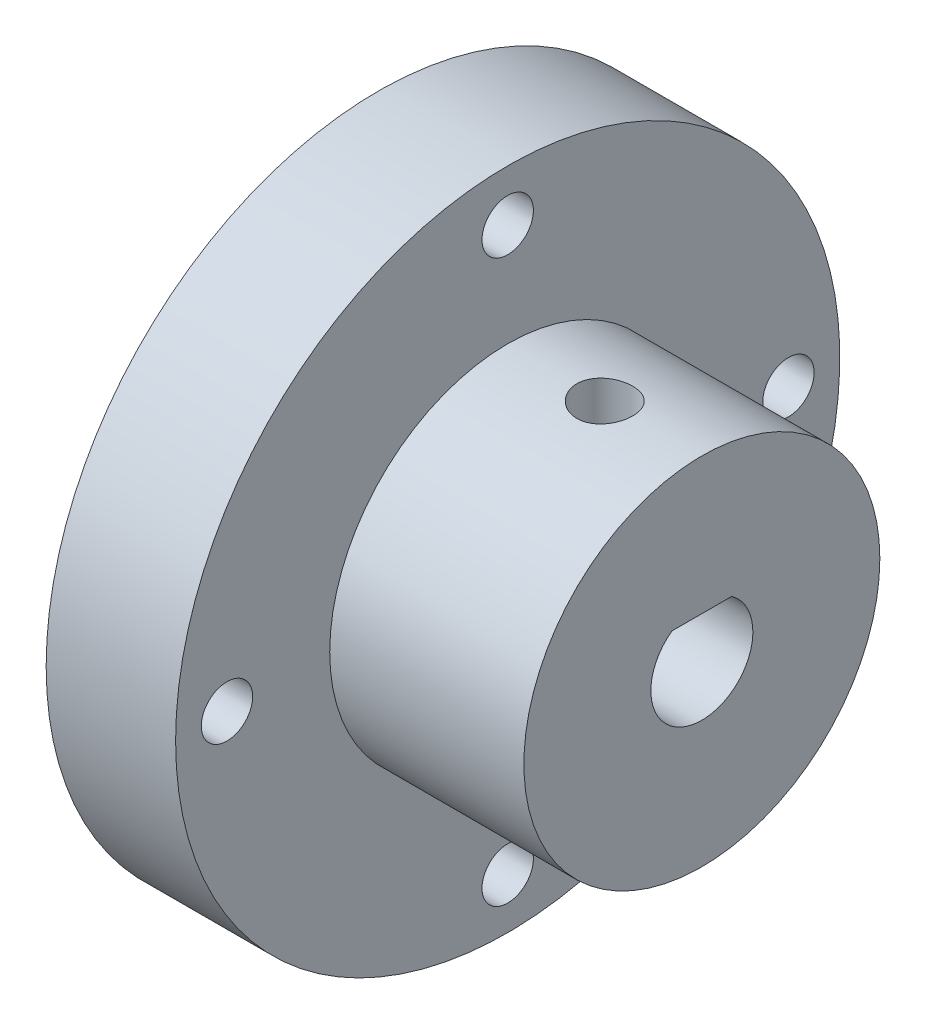
ISO-10303-21;
HEADER;
FILE_DESCRIPTION(('STEP AP214'),'2;1');
FILE_NAME('part.step','',(''),(''),'','','');
FILE_SCHEMA(('AUTOMOTIVE_DESIGN { 1 0 10303 214 1 1 1 1 }'));
ENDSEC;
DATA;
#1=APPLICATION_CONTEXT('core data for automotive mechanical design processes');
#2=APPLICATION_PROTOCOL_DEFINITION('international standard','automotive_design',2000,#1);
#3=PRODUCT_CONTEXT('',#1,'mechanical');
#4=PRODUCT('Part','Part','',(#3));
#5=PRODUCT_RELATED_PRODUCT_CATEGORY('part','',(#4));
#6=PRODUCT_DEFINITION_FORMATION('','',#4);
#7=PRODUCT_DEFINITION_CONTEXT('part definition',#1,'design');
#8=PRODUCT_DEFINITION('design','',#6,#7);
#9=PRODUCT_DEFINITION_SHAPE('','',#8);
#10=(LENGTH_UNIT() NAMED_UNIT(*) SI_UNIT(.MILLI.,.METRE.));
#11=(NAMED_UNIT(*) PLANE_ANGLE_UNIT() SI_UNIT($,.RADIAN.));
#12=(NAMED_UNIT(*) SI_UNIT($,.STERADIAN.) SOLID_ANGLE_UNIT());
#13=UNCERTAINTY_MEASURE_WITH_UNIT(LENGTH_MEASURE(1.E-05),#10,'distance_accuracy_value','');
#14=(GEOMETRIC_REPRESENTATION_CONTEXT(3) GLOBAL_UNCERTAINTY_ASSIGNED_CONTEXT((#13)) GLOBAL_UNIT_ASSIGNED_CONTEXT((#10,
#11,#12)) REPRESENTATION_CONTEXT('',''));
#15=CARTESIAN_POINT('',(0.,0.,0.));
#16=DIRECTION('',(0.,0.,1.));
#17=DIRECTION('',(1.,0.,0.));
#18=AXIS2_PLACEMENT_3D('',#15,#16,#17);
#19=CARTESIAN_POINT('',(127.837955952687,-6.875,0.));
#20=DIRECTION('',(1.,0.,0.));
#21=DIRECTION('',(0.,0.,-1.));
#22=AXIS2_PLACEMENT_3D('',#19,#20,#21);
#23=CYLINDRICAL_SURFACE('',#22,10.9999999999998);
#24=CARTESIAN_POINT('',(133.837955952687,3.98855283321235,-1.72719999999998));
#25=CARTESIAN_POINT('',(133.741582164186,3.98855450094201,-1.72719606137562));
#26=CARTESIAN_POINT('',(133.645153784297,3.98984915929709,-1.71910655338466));
#27=CARTESIAN_POINT('',(133.454996967914,3.99488390785363,-1.68697308164134));
#28=CARTESIAN_POINT('',(133.361271195248,3.99862633009087,-1.66291390292531));
#29=CARTESIAN_POINT('',(133.179299390597,4.00812252060285,-1.59958199104845));
#30=CARTESIAN_POINT('',(133.091049065102,4.01387468887242,-1.56032135743422));
#31=CARTESIAN_POINT('',(132.922399846018,4.02674035181642,-1.46773018643057));
#32=CARTESIAN_POINT('',(132.841999954225,4.03385367307518,-1.41440144104074));
#33=CARTESIAN_POINT('',(132.690618155758,4.04870981442783,-1.29468911194899));
#34=CARTESIAN_POINT('',(132.619715008976,4.05645713164937,-1.22820647786876));
#35=CARTESIAN_POINT('',(132.490022545965,4.07166827802654,-1.08428753579914));
#36=CARTESIAN_POINT('',(132.431233916657,4.07913209108724,-1.00685060709467));
#37=CARTESIAN_POINT('',(132.327146583678,4.09298254154328,-0.842714236482703));
#38=CARTESIAN_POINT('',(132.28192073209,4.09936328449077,-0.755968055496532));
#39=CARTESIAN_POINT('',(132.206710571123,4.11027874992955,-0.575993551775798));
#40=CARTESIAN_POINT('',(132.176725380783,4.11481357911768,-0.482765604062736));
#41=CARTESIAN_POINT('',(132.133087362895,4.12149452938,-0.293286221978619));
#42=CARTESIAN_POINT('',(132.119302452618,4.12365995829595,-0.197065898736473));
#43=CARTESIAN_POINT('',(132.10804592829,4.12542436406966,-0.00365524576250754));
#44=CARTESIAN_POINT('',(132.110573324763,4.12502349659446,0.0935350247769484));
#45=CARTESIAN_POINT('',(132.131765938019,4.12171584501062,0.285224758765083));
#46=CARTESIAN_POINT('',(132.150289035801,4.11883113010667,0.379740369474631));
#47=CARTESIAN_POINT('',(132.202723879313,4.11090449935043,0.564305000498965));
#48=CARTESIAN_POINT('',(132.236636051459,4.1058625237228,0.654353896968815));
#49=CARTESIAN_POINT('',(132.319030150916,4.09415009410192,0.82785603167086));
#50=CARTESIAN_POINT('',(132.367571388062,4.08747303212242,0.911280640125496));
#51=CARTESIAN_POINT('',(132.477802347883,4.073233642306,1.06885395923958));
#52=CARTESIAN_POINT('',(132.539493017491,4.06567125073127,1.14300200125228));
#53=CARTESIAN_POINT('',(132.675061979254,4.05040745995442,1.28075594547385));
#54=CARTESIAN_POINT('',(132.749064409706,4.04270544089717,1.34423967098144));
#55=CARTESIAN_POINT('',(132.906735907637,4.02810965559152,1.45790745790038));
#56=CARTESIAN_POINT('',(132.99040504597,4.0212158952682,1.50809142181903));
#57=CARTESIAN_POINT('',(133.165168101527,4.0090171290002,1.59375471030395));
#58=CARTESIAN_POINT('',(133.256268712566,4.00371357597366,1.62922059875841));
#59=CARTESIAN_POINT('',(133.443235660047,3.99532070896741,1.68431341951108));
#60=CARTESIAN_POINT('',(133.539101626046,3.99223122316043,1.70394158094378));
#61=CARTESIAN_POINT('',(133.731788471707,3.98864915975394,1.72663238804305));
#62=CARTESIAN_POINT('',(133.828588420645,3.98812937060408,1.72986862344594));
#63=CARTESIAN_POINT('',(134.021347697544,3.98967321248436,1.72014513498913));
#64=CARTESIAN_POINT('',(134.11730705407,3.99173675538071,1.7071859636572));
#65=CARTESIAN_POINT('',(134.305117863983,3.99818969636732,1.66558707261261));
#66=CARTESIAN_POINT('',(134.396989126361,4.00256614869939,1.63703460192346));
#67=CARTESIAN_POINT('',(134.574642197797,4.01314104088936,1.56515067502826));
#68=CARTESIAN_POINT('',(134.66042367956,4.01933957858313,1.52181842521005));
#69=CARTESIAN_POINT('',(134.824238043437,4.03292397215392,1.42119093233954));
#70=CARTESIAN_POINT('',(134.902201393865,4.04031917394761,1.36378378049858));
#71=CARTESIAN_POINT('',(135.047449962061,4.05543583091654,1.23679082353464));
#72=CARTESIAN_POINT('',(135.114734515666,4.06315730634645,1.16720426148356));
#73=CARTESIAN_POINT('',(135.237343221498,4.07814196317737,1.01706141926204));
#74=CARTESIAN_POINT('',(135.292552034649,4.08540029253581,0.93641039506751));
#75=CARTESIAN_POINT('',(135.38863674779,4.09856445967651,0.766877675764675));
#76=CARTESIAN_POINT('',(135.429513069914,4.10447033729074,0.677996223164621));
#77=CARTESIAN_POINT('',(135.495590140536,4.11424297989528,0.49487861219056));
#78=CARTESIAN_POINT('',(135.52085284234,4.1181177945176,0.400665257215822));
#79=CARTESIAN_POINT('',(135.555185661229,4.12342561482485,0.209267916562917));
#80=CARTESIAN_POINT('',(135.56425695483,4.12485879792585,0.112084147246147));
#81=CARTESIAN_POINT('',(135.565918637882,4.12511979840211,-0.0813789102979204));
#82=CARTESIAN_POINT('',(135.558685097288,4.12397544970124,-0.177656694641055));
#83=CARTESIAN_POINT('',(135.52832124641,4.11926637381135,-0.367608463648281));
#84=CARTESIAN_POINT('',(135.505191001808,4.11570165662278,-0.46128245906903));
#85=CARTESIAN_POINT('',(135.443754906796,4.10655066793821,-0.643311484025552));
#86=CARTESIAN_POINT('',(135.405462391196,4.10096617315477,-0.731671108961141));
#87=CARTESIAN_POINT('',(135.314807832767,4.08838746855429,-0.900738701147149));
#88=CARTESIAN_POINT('',(135.262445246066,4.08139320424589,-0.98144637245175));
#89=CARTESIAN_POINT('',(135.14450531857,4.0666818854301,-1.13380967891502));
#90=CARTESIAN_POINT('',(135.078798396616,4.05895817475858,-1.20536437638943));
#91=CARTESIAN_POINT('',(134.93630750883,4.04370640454991,-1.33649533455943));
#92=CARTESIAN_POINT('',(134.859520950261,4.03617839129575,-1.3960687836998));
#93=CARTESIAN_POINT('',(134.696487949566,4.0221201479543,-1.50188136131825));
#94=CARTESIAN_POINT('',(134.610185789391,4.01559639586525,-1.54803549649206));
#95=CARTESIAN_POINT('',(134.430989969626,4.00436148299585,-1.625122867049));
#96=CARTESIAN_POINT('',(134.338103158176,3.99964847084876,-1.65607165800908));
#97=CARTESIAN_POINT('',(134.177010371088,3.99363979101371,-1.69496905240089));
#98=CARTESIAN_POINT('',(134.109791675244,3.99174249561103,-1.7070368010495));
#99=CARTESIAN_POINT('',(133.974376413297,3.9891984357644,-1.72315360895853));
#100=CARTESIAN_POINT('',(133.906179861839,3.98855165261087,-1.72720278818913));
#101=CARTESIAN_POINT('',(133.837955952687,3.98855283321235,-1.72719999999998));
#102=B_SPLINE_CURVE_WITH_KNOTS('',3,(#24,#25,#26,#27,#28,#29,#30,#31,#32,#33,#34,#35,#36,#37,
#38,#39,#40,#41,#42,#43,#44,#45,#46,#47,#48,#49,#50,#51,#52,#53,#54,#55,#56,#57,#58,#59,#60,#61,
#62,#63,#64,#65,#66,#67,#68,#69,#70,#71,#72,#73,#74,#75,#76,#77,#78,#79,#80,#81,#82,#83,#84,#85,
#86,#87,#88,#89,#90,#91,#92,#93,#94,#95,#96,#97,#98,#99,#100,#101),.UNSPECIFIED.,.T.,.F.,(4,2,2,
2,2,2,2,2,2,2,2,2,2,2,2,2,2,2,2,2,2,2,2,2,2,2,2,2,2,2,2,2,2,2,2,2,2,2,4),(0.,0.288871952824753,
0.578019521666526,0.866937416023922,1.15581852570345,1.44696395093358,1.738125880266,
2.03082486278384,2.32350692441951,2.61378578629694,2.90404704053421,3.19175560181875,
3.47947213570967,3.76837120444907,4.0572910847966,4.34932351783204,4.64135809152576,
4.93365867983339,5.22593658109138,5.51511270438839,5.8042789623277,6.09184358552619,
6.37942365217026,6.66936894816278,6.95933227012815,7.2519546504729,7.54456841148794,
7.83601352793892,8.12743746623261,8.41572951807279,8.70402037875657,8.99205825655828,
9.28010726992959,9.57110003891341,9.86216101365112,10.1550271974969,10.4475931422862,
10.6520913677953,10.8565865336719),.UNSPECIFIED.);
#103=CARTESIAN_POINT('',(133.837955952687,3.98855283321235,-1.72719999999998));
#104=VERTEX_POINT('',#103);
#105=EDGE_CURVE('E40',#104,#104,#102,.T.);
#106=ORIENTED_EDGE('',*,*,#105,.F.);
#107=EDGE_LOOP('',(#106));
#108=FACE_BOUND('',#107,.T.);
#109=CARTESIAN_POINT('',(127.837955952687,-6.875,0.));
#110=DIRECTION('',(-1.,0.,0.));
#111=DIRECTION('',(0.,0.,1.));
#112=AXIS2_PLACEMENT_3D('',#109,#110,#111);
#113=CIRCLE('',#112,10.9999999999998);
#114=CARTESIAN_POINT('',(127.837955952687,-6.875,10.9999999999998));
#115=VERTEX_POINT('',#114);
#116=EDGE_CURVE('E50',#115,#115,#113,.F.);
#117=ORIENTED_EDGE('',*,*,#116,.T.);
#118=EDGE_LOOP('',(#117));
#119=FACE_BOUND('',#118,.T.);
#120=CARTESIAN_POINT('',(139.837955952687,-6.875,0.));
#121=DIRECTION('',(1.,0.,0.));
#122=DIRECTION('',(0.,0.,-1.));
#123=AXIS2_PLACEMENT_3D('',#120,#121,#122);
#124=CIRCLE('',#123,10.9999999999998);
#125=CARTESIAN_POINT('',(139.837955952687,-6.875,-10.9999999999998));
#126=VERTEX_POINT('',#125);
#127=EDGE_CURVE('E12',#126,#126,#124,.T.);
#128=ORIENTED_EDGE('',*,*,#127,.F.);
#129=EDGE_LOOP('',(#128));
#130=FACE_BOUND('',#129,.T.);
#131=ADVANCED_FACE('F36',(#108,#119,#130),#23,.T.);
#132=CARTESIAN_POINT('',(139.837955952687,-6.875,0.));
#133=DIRECTION('',(1.,0.,0.));
#134=DIRECTION('',(0.,0.,-1.));
#135=AXIS2_PLACEMENT_3D('',#132,#133,#134);
#136=PLANE('',#135);
#137=DIRECTION('',(0.,0.,1.));
#138=VECTOR('',#137,1.);
#139=CARTESIAN_POINT('',(139.837955952687,-4.32260000000017,0.));
#140=LINE('',#139,#138);
#141=CARTESIAN_POINT('',(139.837955952687,-4.32260000000017,-1.8501026998526));
#142=VERTEX_POINT('',#141);
#143=CARTESIAN_POINT('',(139.837955952687,-4.32260000000017,1.8501026998526));
#144=VERTEX_POINT('',#143);
#145=EDGE_CURVE('E59',#142,#144,#140,.T.);
#146=ORIENTED_EDGE('',*,*,#145,.F.);
#147=CARTESIAN_POINT('',(139.837955952687,-6.875,0.));
#148=DIRECTION('',(1.,0.,0.));
#149=DIRECTION('',(0.,0.,-1.));
#150=AXIS2_PLACEMENT_3D('',#147,#148,#149);
#151=CIRCLE('',#150,3.15240000000016);
#152=EDGE_CURVE('E79',#144,#142,#151,.T.);
#153=ORIENTED_EDGE('',*,*,#152,.F.);
#154=EDGE_LOOP('',(#146,#153));
#155=FACE_BOUND('',#154,.T.);
#156=ORIENTED_EDGE('',*,*,#127,.T.);
#157=EDGE_LOOP('',(#156));
#158=FACE_BOUND('',#157,.T.);
#159=ADVANCED_FACE('F118',(#155,#158),#136,.T.);
#160=CARTESIAN_POINT('',(119.837955952687,-6.875,0.));
#161=DIRECTION('',(1.,0.,0.));
#162=DIRECTION('',(0.,0.,-1.));
#163=AXIS2_PLACEMENT_3D('',#160,#161,#162);
#164=CYLINDRICAL_SURFACE('',#163,20.5249999999999);
#165=CARTESIAN_POINT('',(119.837955952687,-6.875,0.));
#166=DIRECTION('',(-1.,0.,0.));
#167=DIRECTION('',(0.,0.,1.));
#168=AXIS2_PLACEMENT_3D('',#165,#166,#167);
#169=CIRCLE('',#168,20.5249999999999);
#170=CARTESIAN_POINT('',(119.837955952687,-6.875,20.5249999999999));
#171=VERTEX_POINT('',#170);
#172=EDGE_CURVE('E83',#171,#171,#169,.T.);
#173=ORIENTED_EDGE('',*,*,#172,.F.);
#174=EDGE_LOOP('',(#173));
#175=FACE_BOUND('',#174,.T.);
#176=CARTESIAN_POINT('',(127.837955952687,-6.875,0.));
#177=DIRECTION('',(-1.,0.,0.));
#178=DIRECTION('',(0.,0.,1.));
#179=AXIS2_PLACEMENT_3D('',#176,#177,#178);
#180=CIRCLE('',#179,20.5249999999999);
#181=CARTESIAN_POINT('',(127.837955952687,-6.875,20.5249999999999));
#182=VERTEX_POINT('',#181);
#183=EDGE_CURVE('E80',#182,#182,#180,.T.);
#184=ORIENTED_EDGE('',*,*,#183,.T.);
#185=EDGE_LOOP('',(#184));
#186=FACE_BOUND('',#185,.T.);
#187=ADVANCED_FACE('F116',(#175,#186),#164,.T.);
#188=CARTESIAN_POINT('',(119.837955952687,-6.875,0.));
#189=DIRECTION('',(-1.,0.,0.));
#190=DIRECTION('',(0.,0.,1.));
#191=AXIS2_PLACEMENT_3D('',#188,#189,#190);
#192=PLANE('',#191);
#193=CARTESIAN_POINT('',(119.837955952687,-6.875,0.));
#194=DIRECTION('',(-1.,0.,0.));
#195=DIRECTION('',(0.,0.,1.));
#196=AXIS2_PLACEMENT_3D('',#193,#194,#195);
#197=CIRCLE('',#196,1.5);
#198=CARTESIAN_POINT('',(119.837955952687,-6.875,1.5));
#199=VERTEX_POINT('',#198);
#200=EDGE_CURVE('E153',#199,#199,#197,.T.);
#201=ORIENTED_EDGE('',*,*,#200,.F.);
#202=EDGE_LOOP('',(#201));
#203=FACE_BOUND('',#202,.T.);
#204=CARTESIAN_POINT('',(119.837955952687,-6.875,-17.3499999999998));
#205=DIRECTION('',(-1.,0.,0.));
#206=DIRECTION('',(0.,0.,1.));
#207=AXIS2_PLACEMENT_3D('',#204,#205,#206);
#208=CIRCLE('',#207,1.5875);
#209=CARTESIAN_POINT('',(119.837955952687,-6.875,-15.7624999999998));
#210=VERTEX_POINT('',#209);
#211=EDGE_CURVE('E157',#210,#210,#208,.T.);
#212=ORIENTED_EDGE('',*,*,#211,.F.);
#213=EDGE_LOOP('',(#212));
#214=FACE_BOUND('',#213,.T.);
#215=CARTESIAN_POINT('',(119.837955952687,10.4749999999998,0.));
#216=DIRECTION('',(-1.,0.,0.));
#217=DIRECTION('',(0.,0.,1.));
#218=AXIS2_PLACEMENT_3D('',#215,#216,#217);
#219=CIRCLE('',#218,1.5875);
#220=CARTESIAN_POINT('',(119.837955952687,10.4749999999998,1.5875));
#221=VERTEX_POINT('',#220);
#222=EDGE_CURVE('E163',#221,#221,#219,.T.);
#223=ORIENTED_EDGE('',*,*,#222,.F.);
#224=EDGE_LOOP('',(#223));
#225=FACE_BOUND('',#224,.T.);
#226=CARTESIAN_POINT('',(119.837955952687,-6.875,17.3499999999998));
#227=DIRECTION('',(-1.,0.,0.));
#228=DIRECTION('',(0.,0.,1.));
#229=AXIS2_PLACEMENT_3D('',#226,#227,#228);
#230=CIRCLE('',#229,1.5875);
#231=CARTESIAN_POINT('',(119.837955952687,-6.875,18.9374999999998));
#232=VERTEX_POINT('',#231);
#233=EDGE_CURVE('E169',#232,#232,#230,.T.);
#234=ORIENTED_EDGE('',*,*,#233,.F.);
#235=EDGE_LOOP('',(#234));
#236=FACE_BOUND('',#235,.T.);
#237=CARTESIAN_POINT('',(119.837955952687,-24.2249999999998,0.));
#238=DIRECTION('',(-1.,0.,0.));
#239=DIRECTION('',(0.,0.,1.));
#240=AXIS2_PLACEMENT_3D('',#237,#238,#239);
#241=CIRCLE('',#240,1.5875);
#242=CARTESIAN_POINT('',(119.837955952687,-24.2249999999998,1.5875));
#243=VERTEX_POINT('',#242);
#244=EDGE_CURVE('E92',#243,#243,#241,.T.);
#245=ORIENTED_EDGE('',*,*,#244,.F.);
#246=EDGE_LOOP('',(#245));
#247=FACE_BOUND('',#246,.T.);
#248=ORIENTED_EDGE('',*,*,#172,.T.);
#249=EDGE_LOOP('',(#248));
#250=FACE_BOUND('',#249,.T.);
#251=ADVANCED_FACE('F111',(#203,#214,#225,#236,#247,#250),#192,.T.);
#252=CARTESIAN_POINT('',(127.837955952687,-6.875,0.));
#253=DIRECTION('',(-1.,0.,0.));
#254=DIRECTION('',(0.,0.,1.));
#255=AXIS2_PLACEMENT_3D('',#252,#253,#254);
#256=PLANE('',#255);
#257=CARTESIAN_POINT('',(127.837955952687,-6.875,-17.3499999999998));
#258=DIRECTION('',(-1.,0.,0.));
#259=DIRECTION('',(0.,0.,1.));
#260=AXIS2_PLACEMENT_3D('',#257,#258,#259);
#261=CIRCLE('',#260,1.5875);
#262=CARTESIAN_POINT('',(127.837955952687,-6.875,-15.7624999999998));
#263=VERTEX_POINT('',#262);
#264=EDGE_CURVE('E97',#263,#263,#261,.F.);
#265=ORIENTED_EDGE('',*,*,#264,.F.);
#266=EDGE_LOOP('',(#265));
#267=FACE_BOUND('',#266,.T.);
#268=CARTESIAN_POINT('',(127.837955952687,10.4749999999998,0.));
#269=DIRECTION('',(-1.,0.,0.));
#270=DIRECTION('',(0.,0.,1.));
#271=AXIS2_PLACEMENT_3D('',#268,#269,#270);
#272=CIRCLE('',#271,1.5875);
#273=CARTESIAN_POINT('',(127.837955952687,10.4749999999998,1.5875));
#274=VERTEX_POINT('',#273);
#275=EDGE_CURVE('E160',#274,#274,#272,.F.);
#276=ORIENTED_EDGE('',*,*,#275,.F.);
#277=EDGE_LOOP('',(#276));
#278=FACE_BOUND('',#277,.T.);
#279=CARTESIAN_POINT('',(127.837955952687,-6.875,17.3499999999998));
#280=DIRECTION('',(-1.,0.,0.));
#281=DIRECTION('',(0.,0.,1.));
#282=AXIS2_PLACEMENT_3D('',#279,#280,#281);
#283=CIRCLE('',#282,1.5875);
#284=CARTESIAN_POINT('',(127.837955952687,-6.875,18.9374999999998));
#285=VERTEX_POINT('',#284);
#286=EDGE_CURVE('E166',#285,#285,#283,.F.);
#287=ORIENTED_EDGE('',*,*,#286,.F.);
#288=EDGE_LOOP('',(#287));
#289=FACE_BOUND('',#288,.T.);
#290=CARTESIAN_POINT('',(127.837955952687,-24.2249999999998,0.));
#291=DIRECTION('',(-1.,0.,0.));
#292=DIRECTION('',(0.,0.,1.));
#293=AXIS2_PLACEMENT_3D('',#290,#291,#292);
#294=CIRCLE('',#293,1.5875);
#295=CARTESIAN_POINT('',(127.837955952687,-24.2249999999998,1.5875));
#296=VERTEX_POINT('',#295);
#297=EDGE_CURVE('E90',#296,#296,#294,.F.);
#298=ORIENTED_EDGE('',*,*,#297,.F.);
#299=EDGE_LOOP('',(#298));
#300=FACE_BOUND('',#299,.T.);
#301=ORIENTED_EDGE('',*,*,#116,.F.);
#302=EDGE_LOOP('',(#301));
#303=FACE_BOUND('',#302,.T.);
#304=ORIENTED_EDGE('',*,*,#183,.F.);
#305=EDGE_LOOP('',(#304));
#306=FACE_BOUND('',#305,.T.);
#307=ADVANCED_FACE('F108',(#267,#278,#289,#300,#303,#306),#256,.F.);
#308=CARTESIAN_POINT('',(127.837955952687,-6.875,0.));
#309=DIRECTION('',(-1.,0.,0.));
#310=DIRECTION('',(0.,0.,1.));
#311=AXIS2_PLACEMENT_3D('',#308,#309,#310);
#312=PLANE('',#311);
#313=CARTESIAN_POINT('',(127.837955952687,-6.875,0.));
#314=DIRECTION('',(-1.,0.,0.));
#315=DIRECTION('',(0.,0.,1.));
#316=AXIS2_PLACEMENT_3D('',#313,#314,#315);
#317=CIRCLE('',#316,1.5);
#318=CARTESIAN_POINT('',(127.837955952687,-6.875,1.5));
#319=VERTEX_POINT('',#318);
#320=EDGE_CURVE('E87',#319,#319,#317,.T.);
#321=ORIENTED_EDGE('',*,*,#320,.T.);
#322=EDGE_LOOP('',(#321));
#323=FACE_BOUND('',#322,.T.);
#324=CARTESIAN_POINT('',(127.837955952687,-6.875,0.));
#325=DIRECTION('',(-1.,0.,0.));
#326=DIRECTION('',(0.,0.,1.));
#327=AXIS2_PLACEMENT_3D('',#324,#325,#326);
#328=CIRCLE('',#327,3.15240000000016);
#329=CARTESIAN_POINT('',(127.837955952687,-4.32260000000017,1.8501026998526));
#330=VERTEX_POINT('',#329);
#331=CARTESIAN_POINT('',(127.837955952687,-4.32260000000017,-1.8501026998526));
#332=VERTEX_POINT('',#331);
#333=EDGE_CURVE('E67',#330,#332,#328,.F.);
#334=ORIENTED_EDGE('',*,*,#333,.T.);
#335=DIRECTION('',(0.,0.,1.));
#336=VECTOR('',#335,1.);
#337=CARTESIAN_POINT('',(127.837955952687,-4.32260000000017,-1.80000000000049));
#338=LINE('',#337,#336);
#339=EDGE_CURVE('E70',#332,#330,#338,.T.);
#340=ORIENTED_EDGE('',*,*,#339,.T.);
#341=EDGE_LOOP('',(#334,#340));
#342=FACE_BOUND('',#341,.T.);
#343=ADVANCED_FACE('F77',(#323,#342),#312,.F.);
#344=CARTESIAN_POINT('',(119.765781524443,-4.32260000000017,-1.80000000000049));
#345=DIRECTION('',(0.,1.,0.));
#346=DIRECTION('',(0.,0.,1.));
#347=AXIS2_PLACEMENT_3D('',#344,#345,#346);
#348=PLANE('',#347);
#349=CARTESIAN_POINT('',(133.837955952687,-4.32260000000017,0.));
#350=DIRECTION('',(0.,-1.,0.));
#351=DIRECTION('',(0.,0.,-1.));
#352=AXIS2_PLACEMENT_3D('',#349,#350,#351);
#353=CIRCLE('',#352,1.72719999999998);
#354=CARTESIAN_POINT('',(133.837955952687,-4.32260000000017,-1.72719999999998));
#355=VERTEX_POINT('',#354);
#356=EDGE_CURVE('E149',#355,#355,#353,.T.);
#357=ORIENTED_EDGE('',*,*,#356,.F.);
#358=EDGE_LOOP('',(#357));
#359=FACE_BOUND('',#358,.T.);
#360=DIRECTION('',(1.,0.,0.));
#361=VECTOR('',#360,1.);
#362=CARTESIAN_POINT('',(127.837955952687,-4.32260000000017,-1.8501026998526));
#363=LINE('',#362,#361);
#364=EDGE_CURVE('E72',#332,#142,#363,.T.);
#365=ORIENTED_EDGE('',*,*,#364,.T.);
#366=ORIENTED_EDGE('',*,*,#145,.T.);
#367=DIRECTION('',(1.,0.,0.));
#368=VECTOR('',#367,1.);
#369=CARTESIAN_POINT('',(127.837955952687,-4.32260000000017,1.8501026998526));
#370=LINE('',#369,#368);
#371=EDGE_CURVE('E74',#330,#144,#370,.T.);
#372=ORIENTED_EDGE('',*,*,#371,.F.);
#373=ORIENTED_EDGE('',*,*,#339,.F.);
#374=EDGE_LOOP('',(#365,#366,#372,#373));
#375=FACE_BOUND('',#374,.T.);
#376=ADVANCED_FACE('F71',(#359,#375),#348,.F.);
#377=CARTESIAN_POINT('',(119.765781524443,-6.875,0.));
#378=DIRECTION('',(1.,0.,0.));
#379=DIRECTION('',(0.,0.,-1.));
#380=AXIS2_PLACEMENT_3D('',#377,#378,#379);
#381=CYLINDRICAL_SURFACE('',#380,3.15240000000016);
#382=ORIENTED_EDGE('',*,*,#371,.T.);
#383=ORIENTED_EDGE('',*,*,#152,.T.);
#384=ORIENTED_EDGE('',*,*,#364,.F.);
#385=ORIENTED_EDGE('',*,*,#333,.F.);
#386=EDGE_LOOP('',(#382,#383,#384,#385));
#387=FACE_BOUND('',#386,.T.);
#388=ADVANCED_FACE('F38',(#387),#381,.F.);
#389=CARTESIAN_POINT('',(132.328084013222,-24.2249999999998,0.));
#390=DIRECTION('',(-1.,0.,0.));
#391=DIRECTION('',(0.,0.,1.));
#392=AXIS2_PLACEMENT_3D('',#389,#390,#391);
#393=CYLINDRICAL_SURFACE('',#392,1.5875);
#394=ORIENTED_EDGE('',*,*,#297,.T.);
#395=EDGE_LOOP('',(#394));
#396=FACE_BOUND('',#395,.T.);
#397=ORIENTED_EDGE('',*,*,#244,.T.);
#398=EDGE_LOOP('',(#397));
#399=FACE_BOUND('',#398,.T.);
#400=ADVANCED_FACE('F143',(#396,#399),#393,.F.);
#401=CARTESIAN_POINT('',(132.328084013222,-6.875,17.3499999999998));
#402=DIRECTION('',(-1.,0.,0.));
#403=DIRECTION('',(0.,0.,1.));
#404=AXIS2_PLACEMENT_3D('',#401,#402,#403);
#405=CYLINDRICAL_SURFACE('',#404,1.5875);
#406=ORIENTED_EDGE('',*,*,#286,.T.);
#407=EDGE_LOOP('',(#406));
#408=FACE_BOUND('',#407,.T.);
#409=ORIENTED_EDGE('',*,*,#233,.T.);
#410=EDGE_LOOP('',(#409));
#411=FACE_BOUND('',#410,.T.);
#412=ADVANCED_FACE('F174',(#408,#411),#405,.F.);
#413=CARTESIAN_POINT('',(132.328084013222,10.4749999999998,0.));
#414=DIRECTION('',(-1.,0.,0.));
#415=DIRECTION('',(0.,0.,1.));
#416=AXIS2_PLACEMENT_3D('',#413,#414,#415);
#417=CYLINDRICAL_SURFACE('',#416,1.5875);
#418=ORIENTED_EDGE('',*,*,#275,.T.);
#419=EDGE_LOOP('',(#418));
#420=FACE_BOUND('',#419,.T.);
#421=ORIENTED_EDGE('',*,*,#222,.T.);
#422=EDGE_LOOP('',(#421));
#423=FACE_BOUND('',#422,.T.);
#424=ADVANCED_FACE('F179',(#420,#423),#417,.F.);
#425=CARTESIAN_POINT('',(132.328084013222,-6.875,-17.3499999999998));
#426=DIRECTION('',(-1.,0.,0.));
#427=DIRECTION('',(0.,0.,1.));
#428=AXIS2_PLACEMENT_3D('',#425,#426,#427);
#429=CYLINDRICAL_SURFACE('',#428,1.5875);
#430=ORIENTED_EDGE('',*,*,#264,.T.);
#431=EDGE_LOOP('',(#430));
#432=FACE_BOUND('',#431,.T.);
#433=ORIENTED_EDGE('',*,*,#211,.T.);
#434=EDGE_LOOP('',(#433));
#435=FACE_BOUND('',#434,.T.);
#436=ADVANCED_FACE('F194',(#432,#435),#429,.F.);
#437=CARTESIAN_POINT('',(139.837955952687,-6.875,0.));
#438=DIRECTION('',(-1.,0.,0.));
#439=DIRECTION('',(0.,0.,1.));
#440=AXIS2_PLACEMENT_3D('',#437,#438,#439);
#441=CYLINDRICAL_SURFACE('',#440,1.5);
#442=ORIENTED_EDGE('',*,*,#200,.T.);
#443=EDGE_LOOP('',(#442));
#444=FACE_BOUND('',#443,.T.);
#445=ORIENTED_EDGE('',*,*,#320,.F.);
#446=EDGE_LOOP('',(#445));
#447=FACE_BOUND('',#446,.T.);
#448=ADVANCED_FACE('F198',(#444,#447),#441,.F.);
#449=CARTESIAN_POINT('',(133.837955952687,-4.32260000000017,0.));
#450=DIRECTION('',(0.,-1.,0.));
#451=DIRECTION('',(0.,0.,-1.));
#452=AXIS2_PLACEMENT_3D('',#449,#450,#451);
#453=CYLINDRICAL_SURFACE('',#452,1.72719999999998);
#454=ORIENTED_EDGE('',*,*,#105,.T.);
#455=EDGE_LOOP('',(#454));
#456=FACE_BOUND('',#455,.T.);
#457=ORIENTED_EDGE('',*,*,#356,.T.);
#458=EDGE_LOOP('',(#457));
#459=FACE_BOUND('',#458,.T.);
#460=ADVANCED_FACE('F201',(#456,#459),#453,.F.);
#461=CLOSED_SHELL('',(#131,#159,#187,#251,#307,#343,#376,#388,#400,#412,#424,#436,#448,#460));
#462=MANIFOLD_SOLID_BREP('B2',#461);
#463=ADVANCED_BREP_SHAPE_REPRESENTATION('',(#18,#462),#14);
#464=SHAPE_DEFINITION_REPRESENTATION(#9,#463);
ENDSEC;
END-ISO-10303-21;
